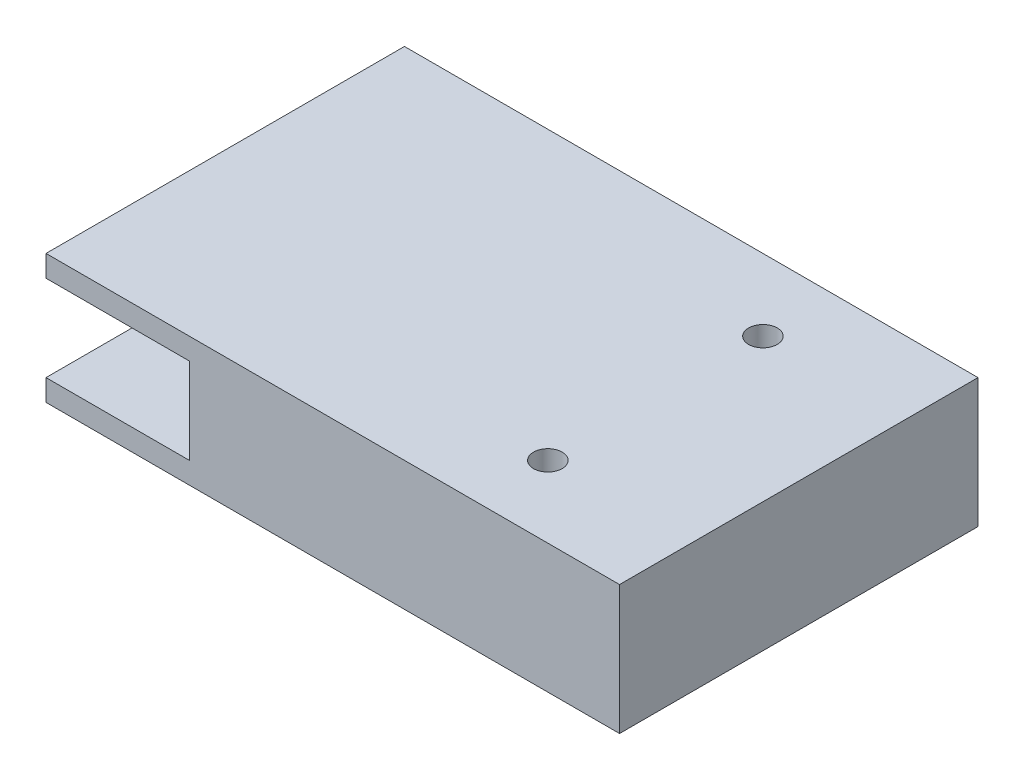
ISO-10303-21;
HEADER;
FILE_DESCRIPTION(('STEP AP214'),'2;1');
FILE_NAME('part.step','',(''),(''),'','','');
FILE_SCHEMA(('AUTOMOTIVE_DESIGN { 1 0 10303 214 1 1 1 1 }'));
ENDSEC;
DATA;
#1=APPLICATION_CONTEXT('core data for automotive mechanical design processes');
#2=APPLICATION_PROTOCOL_DEFINITION('international standard','automotive_design',2000,#1);
#3=PRODUCT_CONTEXT('',#1,'mechanical');
#4=PRODUCT('Part','Part','',(#3));
#5=PRODUCT_RELATED_PRODUCT_CATEGORY('part','',(#4));
#6=PRODUCT_DEFINITION_FORMATION('','',#4);
#7=PRODUCT_DEFINITION_CONTEXT('part definition',#1,'design');
#8=PRODUCT_DEFINITION('design','',#6,#7);
#9=PRODUCT_DEFINITION_SHAPE('','',#8);
#10=(LENGTH_UNIT() NAMED_UNIT(*) SI_UNIT(.MILLI.,.METRE.));
#11=(NAMED_UNIT(*) PLANE_ANGLE_UNIT() SI_UNIT($,.RADIAN.));
#12=(NAMED_UNIT(*) SI_UNIT($,.STERADIAN.) SOLID_ANGLE_UNIT());
#13=UNCERTAINTY_MEASURE_WITH_UNIT(LENGTH_MEASURE(1.E-05),#10,'distance_accuracy_value','');
#14=(GEOMETRIC_REPRESENTATION_CONTEXT(3) GLOBAL_UNCERTAINTY_ASSIGNED_CONTEXT((#13)) GLOBAL_UNIT_ASSIGNED_CONTEXT((#10,
#11,#12)) REPRESENTATION_CONTEXT('',''));
#15=CARTESIAN_POINT('',(0.,0.,0.));
#16=DIRECTION('',(0.,0.,1.));
#17=DIRECTION('',(1.,0.,0.));
#18=AXIS2_PLACEMENT_3D('',#15,#16,#17);
#19=CARTESIAN_POINT('',(-40.,3.,-25.));
#20=DIRECTION('',(0.,0.,1.));
#21=DIRECTION('',(1.,0.,0.));
#22=AXIS2_PLACEMENT_3D('',#19,#20,#21);
#23=PLANE('',#22);
#24=DIRECTION('',(0.866025403784439,0.5,0.));
#25=VECTOR('',#24,1.);
#26=CARTESIAN_POINT('',(-17.,10.1547005383793,-25.));
#27=LINE('',#26,#25);
#28=CARTESIAN_POINT('',(-17.,10.1547005383793,-25.));
#29=VERTEX_POINT('',#28);
#30=CARTESIAN_POINT('',(-15.,11.3094010767585,-25.));
#31=VERTEX_POINT('',#30);
#32=EDGE_CURVE('E198',#29,#31,#27,.T.);
#33=ORIENTED_EDGE('',*,*,#32,.F.);
#34=DIRECTION('',(0.,1.,0.));
#35=VECTOR('',#34,1.);
#36=CARTESIAN_POINT('',(-17.,7.84529946162075,-25.));
#37=LINE('',#36,#35);
#38=CARTESIAN_POINT('',(-17.,7.84529946162075,-25.));
#39=VERTEX_POINT('',#38);
#40=EDGE_CURVE('E211',#39,#29,#37,.T.);
#41=ORIENTED_EDGE('',*,*,#40,.F.);
#42=DIRECTION('',(-0.866025403784439,0.5,0.));
#43=VECTOR('',#42,1.);
#44=CARTESIAN_POINT('',(-15.,6.6905989232415,-25.));
#45=LINE('',#44,#43);
#46=CARTESIAN_POINT('',(-15.,6.69059892324149,-25.));
#47=VERTEX_POINT('',#46);
#48=EDGE_CURVE('E230',#47,#39,#45,.T.);
#49=ORIENTED_EDGE('',*,*,#48,.F.);
#50=DIRECTION('',(-0.866025403784439,-0.5,0.));
#51=VECTOR('',#50,1.);
#52=CARTESIAN_POINT('',(-13.,7.84529946162075,-25.));
#53=LINE('',#52,#51);
#54=CARTESIAN_POINT('',(-13.,7.84529946162075,-25.));
#55=VERTEX_POINT('',#54);
#56=EDGE_CURVE('E227',#55,#47,#53,.T.);
#57=ORIENTED_EDGE('',*,*,#56,.F.);
#58=DIRECTION('',(0.,-1.,0.));
#59=VECTOR('',#58,1.);
#60=CARTESIAN_POINT('',(-13.,10.1547005383793,-25.));
#61=LINE('',#60,#59);
#62=CARTESIAN_POINT('',(-13.,10.1547005383793,-25.));
#63=VERTEX_POINT('',#62);
#64=EDGE_CURVE('E224',#63,#55,#61,.T.);
#65=ORIENTED_EDGE('',*,*,#64,.F.);
#66=DIRECTION('',(0.866025403784438,-0.5,0.));
#67=VECTOR('',#66,1.);
#68=CARTESIAN_POINT('',(-15.,11.3094010767585,-25.));
#69=LINE('',#68,#67);
#70=EDGE_CURVE('E201',#31,#63,#69,.T.);
#71=ORIENTED_EDGE('',*,*,#70,.F.);
#72=EDGE_LOOP('',(#33,#41,#49,#57,#65,#71));
#73=FACE_BOUND('',#72,.T.);
#74=DIRECTION('',(-1.,0.,0.));
#75=VECTOR('',#74,1.);
#76=CARTESIAN_POINT('',(-40.,0.,-25.));
#77=LINE('',#76,#75);
#78=CARTESIAN_POINT('',(40.,0.,-25.));
#79=VERTEX_POINT('',#78);
#80=CARTESIAN_POINT('',(-40.,0.,-25.));
#81=VERTEX_POINT('',#80);
#82=EDGE_CURVE('E319',#79,#81,#77,.T.);
#83=ORIENTED_EDGE('',*,*,#82,.T.);
#84=DIRECTION('',(0.,-1.,0.));
#85=VECTOR('',#84,1.);
#86=CARTESIAN_POINT('',(-40.,3.,-25.));
#87=LINE('',#86,#85);
#88=CARTESIAN_POINT('',(-40.,3.,-25.));
#89=VERTEX_POINT('',#88);
#90=EDGE_CURVE('E329',#89,#81,#87,.T.);
#91=ORIENTED_EDGE('',*,*,#90,.F.);
#92=DIRECTION('',(-1.,0.,0.));
#93=VECTOR('',#92,1.);
#94=CARTESIAN_POINT('',(-40.,3.,-25.));
#95=LINE('',#94,#93);
#96=CARTESIAN_POINT('',(-20.,3.,-25.));
#97=VERTEX_POINT('',#96);
#98=EDGE_CURVE('E309',#97,#89,#95,.T.);
#99=ORIENTED_EDGE('',*,*,#98,.F.);
#100=DIRECTION('',(0.,-1.,0.));
#101=VECTOR('',#100,1.);
#102=CARTESIAN_POINT('',(-20.,15.,-25.));
#103=LINE('',#102,#101);
#104=CARTESIAN_POINT('',(-20.,15.,-25.));
#105=VERTEX_POINT('',#104);
#106=EDGE_CURVE('E305',#105,#97,#103,.T.);
#107=ORIENTED_EDGE('',*,*,#106,.F.);
#108=DIRECTION('',(-1.,0.,0.));
#109=VECTOR('',#108,1.);
#110=CARTESIAN_POINT('',(40.,15.,-25.));
#111=LINE('',#110,#109);
#112=CARTESIAN_POINT('',(-40.,15.,-25.));
#113=VERTEX_POINT('',#112);
#114=EDGE_CURVE('E264',#105,#113,#111,.T.);
#115=ORIENTED_EDGE('',*,*,#114,.T.);
#116=DIRECTION('',(0.,-1.,0.));
#117=VECTOR('',#116,1.);
#118=CARTESIAN_POINT('',(-40.,18.,-25.));
#119=LINE('',#118,#117);
#120=CARTESIAN_POINT('',(-40.,18.,-25.));
#121=VERTEX_POINT('',#120);
#122=EDGE_CURVE('E284',#121,#113,#119,.T.);
#123=ORIENTED_EDGE('',*,*,#122,.F.);
#124=DIRECTION('',(-1.,0.,0.));
#125=VECTOR('',#124,1.);
#126=CARTESIAN_POINT('',(40.,18.,-25.));
#127=LINE('',#126,#125);
#128=CARTESIAN_POINT('',(40.,18.,-25.));
#129=VERTEX_POINT('',#128);
#130=EDGE_CURVE('E268',#129,#121,#127,.T.);
#131=ORIENTED_EDGE('',*,*,#130,.F.);
#132=DIRECTION('',(0.,-1.,0.));
#133=VECTOR('',#132,1.);
#134=CARTESIAN_POINT('',(40.,3.,-25.));
#135=LINE('',#134,#133);
#136=EDGE_CURVE('E332',#129,#79,#135,.T.);
#137=ORIENTED_EDGE('',*,*,#136,.T.);
#138=EDGE_LOOP('',(#83,#91,#99,#107,#115,#123,#131,#137));
#139=FACE_BOUND('',#138,.T.);
#140=DIRECTION('',(0.866025403784439,0.5,0.));
#141=VECTOR('',#140,1.);
#142=CARTESIAN_POINT('',(-6.99999999999999,10.1547005383793,-25.));
#143=LINE('',#142,#141);
#144=CARTESIAN_POINT('',(-6.99999999999999,10.1547005383793,-25.));
#145=VERTEX_POINT('',#144);
#146=CARTESIAN_POINT('',(-5.,11.3094010767585,-25.));
#147=VERTEX_POINT('',#146);
#148=EDGE_CURVE('E197',#145,#147,#143,.T.);
#149=ORIENTED_EDGE('',*,*,#148,.F.);
#150=DIRECTION('',(0.,1.,0.));
#151=VECTOR('',#150,1.);
#152=CARTESIAN_POINT('',(-6.99999999999999,7.84529946162075,-25.));
#153=LINE('',#152,#151);
#154=CARTESIAN_POINT('',(-6.99999999999999,7.84529946162075,-25.));
#155=VERTEX_POINT('',#154);
#156=EDGE_CURVE('E194',#155,#145,#153,.T.);
#157=ORIENTED_EDGE('',*,*,#156,.F.);
#158=DIRECTION('',(-0.866025403784438,0.5,0.));
#159=VECTOR('',#158,1.);
#160=CARTESIAN_POINT('',(-4.99999999999999,6.6905989232415,-25.));
#161=LINE('',#160,#159);
#162=CARTESIAN_POINT('',(-4.99999999999999,6.6905989232415,-25.));
#163=VERTEX_POINT('',#162);
#164=EDGE_CURVE('E361',#163,#155,#161,.T.);
#165=ORIENTED_EDGE('',*,*,#164,.F.);
#166=DIRECTION('',(-0.866025403784439,-0.5,0.));
#167=VECTOR('',#166,1.);
#168=CARTESIAN_POINT('',(-2.99999999999999,7.84529946162075,-25.));
#169=LINE('',#168,#167);
#170=CARTESIAN_POINT('',(-2.99999999999999,7.84529946162074,-25.));
#171=VERTEX_POINT('',#170);
#172=EDGE_CURVE('E358',#171,#163,#169,.T.);
#173=ORIENTED_EDGE('',*,*,#172,.F.);
#174=DIRECTION('',(0.,-1.,0.));
#175=VECTOR('',#174,1.);
#176=CARTESIAN_POINT('',(-2.99999999999999,10.1547005383793,-25.));
#177=LINE('',#176,#175);
#178=CARTESIAN_POINT('',(-2.99999999999999,10.1547005383793,-25.));
#179=VERTEX_POINT('',#178);
#180=EDGE_CURVE('E60',#179,#171,#177,.T.);
#181=ORIENTED_EDGE('',*,*,#180,.F.);
#182=DIRECTION('',(0.866025403784439,-0.5,0.));
#183=VECTOR('',#182,1.);
#184=CARTESIAN_POINT('',(-4.99999999999999,11.3094010767585,-25.));
#185=LINE('',#184,#183);
#186=EDGE_CURVE('E55',#147,#179,#185,.T.);
#187=ORIENTED_EDGE('',*,*,#186,.F.);
#188=EDGE_LOOP('',(#149,#157,#165,#173,#181,#187));
#189=FACE_BOUND('',#188,.T.);
#190=ADVANCED_FACE('F38',(#73,#139,#189),#23,.F.);
#191=CARTESIAN_POINT('',(0.,3.,0.));
#192=DIRECTION('',(0.,-1.,0.));
#193=DIRECTION('',(0.,0.,-1.));
#194=AXIS2_PLACEMENT_3D('',#191,#192,#193);
#195=PLANE('',#194);
#196=CARTESIAN_POINT('',(-30.,3.,-11.));
#197=DIRECTION('',(0.,-1.,0.));
#198=DIRECTION('',(0.,0.,-1.));
#199=AXIS2_PLACEMENT_3D('',#196,#197,#198);
#200=CIRCLE('',#199,2.);
#201=CARTESIAN_POINT('',(-30.,3.,-13.));
#202=VERTEX_POINT('',#201);
#203=EDGE_CURVE('E335',#202,#202,#200,.F.);
#204=ORIENTED_EDGE('',*,*,#203,.F.);
#205=EDGE_LOOP('',(#204));
#206=FACE_BOUND('',#205,.T.);
#207=CARTESIAN_POINT('',(-30.,3.,11.));
#208=DIRECTION('',(0.,-1.,0.));
#209=DIRECTION('',(0.,0.,-1.));
#210=AXIS2_PLACEMENT_3D('',#207,#208,#209);
#211=CIRCLE('',#210,2.);
#212=CARTESIAN_POINT('',(-30.,3.,9.));
#213=VERTEX_POINT('',#212);
#214=EDGE_CURVE('E337',#213,#213,#211,.F.);
#215=ORIENTED_EDGE('',*,*,#214,.F.);
#216=EDGE_LOOP('',(#215));
#217=FACE_BOUND('',#216,.T.);
#218=DIRECTION('',(0.,0.,1.));
#219=VECTOR('',#218,1.);
#220=CARTESIAN_POINT('',(-20.,3.,-25.));
#221=LINE('',#220,#219);
#222=CARTESIAN_POINT('',(-20.,3.,25.));
#223=VERTEX_POINT('',#222);
#224=EDGE_CURVE('E294',#97,#223,#221,.T.);
#225=ORIENTED_EDGE('',*,*,#224,.F.);
#226=ORIENTED_EDGE('',*,*,#98,.T.);
#227=DIRECTION('',(0.,0.,1.));
#228=VECTOR('',#227,1.);
#229=CARTESIAN_POINT('',(-40.,3.,25.));
#230=LINE('',#229,#228);
#231=CARTESIAN_POINT('',(-40.,3.,25.));
#232=VERTEX_POINT('',#231);
#233=EDGE_CURVE('E311',#89,#232,#230,.T.);
#234=ORIENTED_EDGE('',*,*,#233,.T.);
#235=DIRECTION('',(1.,0.,0.));
#236=VECTOR('',#235,1.);
#237=CARTESIAN_POINT('',(-40.,3.,25.));
#238=LINE('',#237,#236);
#239=EDGE_CURVE('E314',#232,#223,#238,.T.);
#240=ORIENTED_EDGE('',*,*,#239,.T.);
#241=EDGE_LOOP('',(#225,#226,#234,#240));
#242=FACE_BOUND('',#241,.T.);
#243=ADVANCED_FACE('F387',(#206,#217,#242),#195,.F.);
#244=CARTESIAN_POINT('',(40.,3.,25.));
#245=DIRECTION('',(-1.,0.,0.));
#246=DIRECTION('',(0.,0.,1.));
#247=AXIS2_PLACEMENT_3D('',#244,#245,#246);
#248=PLANE('',#247);
#249=DIRECTION('',(0.,0.,-1.));
#250=VECTOR('',#249,1.);
#251=CARTESIAN_POINT('',(40.,0.,25.));
#252=LINE('',#251,#250);
#253=CARTESIAN_POINT('',(40.,0.,25.));
#254=VERTEX_POINT('',#253);
#255=EDGE_CURVE('E308',#254,#79,#252,.T.);
#256=ORIENTED_EDGE('',*,*,#255,.T.);
#257=ORIENTED_EDGE('',*,*,#136,.F.);
#258=DIRECTION('',(0.,0.,-1.));
#259=VECTOR('',#258,1.);
#260=CARTESIAN_POINT('',(40.,18.,-25.));
#261=LINE('',#260,#259);
#262=CARTESIAN_POINT('',(40.,18.,25.));
#263=VERTEX_POINT('',#262);
#264=EDGE_CURVE('E265',#263,#129,#261,.T.);
#265=ORIENTED_EDGE('',*,*,#264,.F.);
#266=DIRECTION('',(0.,-1.,0.));
#267=VECTOR('',#266,1.);
#268=CARTESIAN_POINT('',(40.,3.,25.));
#269=LINE('',#268,#267);
#270=EDGE_CURVE('E316',#263,#254,#269,.T.);
#271=ORIENTED_EDGE('',*,*,#270,.T.);
#272=EDGE_LOOP('',(#256,#257,#265,#271));
#273=FACE_BOUND('',#272,.T.);
#274=ADVANCED_FACE('F40',(#273),#248,.F.);
#275=CARTESIAN_POINT('',(-40.,3.,25.));
#276=DIRECTION('',(1.,0.,0.));
#277=DIRECTION('',(0.,0.,-1.));
#278=AXIS2_PLACEMENT_3D('',#275,#276,#277);
#279=PLANE('',#278);
#280=DIRECTION('',(0.,0.,1.));
#281=VECTOR('',#280,1.);
#282=CARTESIAN_POINT('',(-40.,0.,25.));
#283=LINE('',#282,#281);
#284=CARTESIAN_POINT('',(-40.,0.,25.));
#285=VERTEX_POINT('',#284);
#286=EDGE_CURVE('E321',#81,#285,#283,.T.);
#287=ORIENTED_EDGE('',*,*,#286,.T.);
#288=DIRECTION('',(0.,-1.,0.));
#289=VECTOR('',#288,1.);
#290=CARTESIAN_POINT('',(-40.,3.,25.));
#291=LINE('',#290,#289);
#292=EDGE_CURVE('E326',#232,#285,#291,.T.);
#293=ORIENTED_EDGE('',*,*,#292,.F.);
#294=ORIENTED_EDGE('',*,*,#233,.F.);
#295=ORIENTED_EDGE('',*,*,#90,.T.);
#296=EDGE_LOOP('',(#287,#293,#294,#295));
#297=FACE_BOUND('',#296,.T.);
#298=ADVANCED_FACE('F396',(#297),#279,.F.);
#299=CARTESIAN_POINT('',(-40.,3.,25.));
#300=DIRECTION('',(0.,0.,-1.));
#301=DIRECTION('',(-1.,0.,0.));
#302=AXIS2_PLACEMENT_3D('',#299,#300,#301);
#303=PLANE('',#302);
#304=DIRECTION('',(1.,0.,0.));
#305=VECTOR('',#304,1.);
#306=CARTESIAN_POINT('',(-40.,0.,25.));
#307=LINE('',#306,#305);
#308=EDGE_CURVE('E312',#285,#254,#307,.T.);
#309=ORIENTED_EDGE('',*,*,#308,.T.);
#310=ORIENTED_EDGE('',*,*,#270,.F.);
#311=DIRECTION('',(1.,0.,0.));
#312=VECTOR('',#311,1.);
#313=CARTESIAN_POINT('',(40.,18.,25.));
#314=LINE('',#313,#312);
#315=CARTESIAN_POINT('',(-40.,18.,25.));
#316=VERTEX_POINT('',#315);
#317=EDGE_CURVE('E273',#316,#263,#314,.T.);
#318=ORIENTED_EDGE('',*,*,#317,.F.);
#319=DIRECTION('',(0.,-1.,0.));
#320=VECTOR('',#319,1.);
#321=CARTESIAN_POINT('',(-40.,18.,25.));
#322=LINE('',#321,#320);
#323=CARTESIAN_POINT('',(-40.,15.,25.));
#324=VERTEX_POINT('',#323);
#325=EDGE_CURVE('E276',#316,#324,#322,.T.);
#326=ORIENTED_EDGE('',*,*,#325,.T.);
#327=DIRECTION('',(1.,0.,0.));
#328=VECTOR('',#327,1.);
#329=CARTESIAN_POINT('',(40.,15.,25.));
#330=LINE('',#329,#328);
#331=CARTESIAN_POINT('',(-20.,15.,25.));
#332=VERTEX_POINT('',#331);
#333=EDGE_CURVE('E269',#324,#332,#330,.T.);
#334=ORIENTED_EDGE('',*,*,#333,.T.);
#335=DIRECTION('',(0.,-1.,0.));
#336=VECTOR('',#335,1.);
#337=CARTESIAN_POINT('',(-20.,15.,25.));
#338=LINE('',#337,#336);
#339=EDGE_CURVE('E300',#332,#223,#338,.T.);
#340=ORIENTED_EDGE('',*,*,#339,.T.);
#341=ORIENTED_EDGE('',*,*,#239,.F.);
#342=ORIENTED_EDGE('',*,*,#292,.T.);
#343=EDGE_LOOP('',(#309,#310,#318,#326,#334,#340,#341,#342));
#344=FACE_BOUND('',#343,.T.);
#345=ADVANCED_FACE('F399',(#344),#303,.F.);
#346=CARTESIAN_POINT('',(0.,0.,0.));
#347=DIRECTION('',(0.,-1.,0.));
#348=DIRECTION('',(0.,0.,-1.));
#349=AXIS2_PLACEMENT_3D('',#346,#347,#348);
#350=PLANE('',#349);
#351=CARTESIAN_POINT('',(20.,0.,15.));
#352=DIRECTION('',(0.,-1.,0.));
#353=DIRECTION('',(0.,0.,-1.));
#354=AXIS2_PLACEMENT_3D('',#351,#352,#353);
#355=CIRCLE('',#354,2.);
#356=CARTESIAN_POINT('',(20.,0.,13.));
#357=VERTEX_POINT('',#356);
#358=EDGE_CURVE('E261',#357,#357,#355,.T.);
#359=ORIENTED_EDGE('',*,*,#358,.F.);
#360=EDGE_LOOP('',(#359));
#361=FACE_BOUND('',#360,.T.);
#362=CARTESIAN_POINT('',(20.,0.,-15.));
#363=DIRECTION('',(0.,-1.,0.));
#364=DIRECTION('',(0.,0.,-1.));
#365=AXIS2_PLACEMENT_3D('',#362,#363,#364);
#366=CIRCLE('',#365,2.);
#367=CARTESIAN_POINT('',(20.,0.,-17.));
#368=VERTEX_POINT('',#367);
#369=EDGE_CURVE('E256',#368,#368,#366,.T.);
#370=ORIENTED_EDGE('',*,*,#369,.F.);
#371=EDGE_LOOP('',(#370));
#372=FACE_BOUND('',#371,.T.);
#373=ORIENTED_EDGE('',*,*,#255,.F.);
#374=ORIENTED_EDGE('',*,*,#308,.F.);
#375=ORIENTED_EDGE('',*,*,#286,.F.);
#376=ORIENTED_EDGE('',*,*,#82,.F.);
#377=EDGE_LOOP('',(#373,#374,#375,#376));
#378=FACE_BOUND('',#377,.T.);
#379=ADVANCED_FACE('F403',(#361,#372,#378),#350,.T.);
#380=CARTESIAN_POINT('',(-30.,17.,-11.));
#381=DIRECTION('',(0.,-1.,0.));
#382=DIRECTION('',(0.,0.,-1.));
#383=AXIS2_PLACEMENT_3D('',#380,#381,#382);
#384=CYLINDRICAL_SURFACE('',#383,2.);
#385=CARTESIAN_POINT('',(-30.,15.,-11.));
#386=DIRECTION('',(0.,-1.,0.));
#387=DIRECTION('',(0.,0.,-1.));
#388=AXIS2_PLACEMENT_3D('',#385,#386,#387);
#389=CIRCLE('',#388,2.);
#390=CARTESIAN_POINT('',(-30.,15.,-13.));
#391=VERTEX_POINT('',#390);
#392=EDGE_CURVE('E287',#391,#391,#389,.T.);
#393=ORIENTED_EDGE('',*,*,#392,.T.);
#394=EDGE_LOOP('',(#393));
#395=FACE_BOUND('',#394,.T.);
#396=ORIENTED_EDGE('',*,*,#203,.T.);
#397=EDGE_LOOP('',(#396));
#398=FACE_BOUND('',#397,.T.);
#399=ADVANCED_FACE('F406',(#395,#398),#384,.T.);
#400=CARTESIAN_POINT('',(-30.,17.,11.));
#401=DIRECTION('',(0.,-1.,0.));
#402=DIRECTION('',(0.,0.,-1.));
#403=AXIS2_PLACEMENT_3D('',#400,#401,#402);
#404=CYLINDRICAL_SURFACE('',#403,2.);
#405=CARTESIAN_POINT('',(-30.,15.,11.));
#406=DIRECTION('',(0.,-1.,0.));
#407=DIRECTION('',(0.,0.,-1.));
#408=AXIS2_PLACEMENT_3D('',#405,#406,#407);
#409=CIRCLE('',#408,2.);
#410=CARTESIAN_POINT('',(-30.,15.,9.));
#411=VERTEX_POINT('',#410);
#412=EDGE_CURVE('E42',#411,#411,#409,.T.);
#413=ORIENTED_EDGE('',*,*,#412,.T.);
#414=EDGE_LOOP('',(#413));
#415=FACE_BOUND('',#414,.T.);
#416=ORIENTED_EDGE('',*,*,#214,.T.);
#417=EDGE_LOOP('',(#416));
#418=FACE_BOUND('',#417,.T.);
#419=ADVANCED_FACE('F411',(#415,#418),#404,.T.);
#420=CARTESIAN_POINT('',(-20.,15.,-25.));
#421=DIRECTION('',(1.,0.,0.));
#422=DIRECTION('',(0.,0.,-1.));
#423=AXIS2_PLACEMENT_3D('',#420,#421,#422);
#424=PLANE('',#423);
#425=CARTESIAN_POINT('',(-20.,11.,0.));
#426=DIRECTION('',(-1.,0.,0.));
#427=DIRECTION('',(0.,0.,1.));
#428=AXIS2_PLACEMENT_3D('',#425,#426,#427);
#429=CIRCLE('',#428,3.);
#430=CARTESIAN_POINT('',(-20.,11.,3.));
#431=VERTEX_POINT('',#430);
#432=EDGE_CURVE('E290',#431,#431,#429,.T.);
#433=ORIENTED_EDGE('',*,*,#432,.F.);
#434=EDGE_LOOP('',(#433));
#435=FACE_BOUND('',#434,.T.);
#436=ORIENTED_EDGE('',*,*,#224,.T.);
#437=ORIENTED_EDGE('',*,*,#339,.F.);
#438=DIRECTION('',(0.,0.,1.));
#439=VECTOR('',#438,1.);
#440=CARTESIAN_POINT('',(-20.,15.,-25.));
#441=LINE('',#440,#439);
#442=EDGE_CURVE('E297',#105,#332,#441,.T.);
#443=ORIENTED_EDGE('',*,*,#442,.F.);
#444=ORIENTED_EDGE('',*,*,#106,.T.);
#445=EDGE_LOOP('',(#436,#437,#443,#444));
#446=FACE_BOUND('',#445,.T.);
#447=ADVANCED_FACE('F415',(#435,#446),#424,.F.);
#448=CARTESIAN_POINT('',(-9.99999999999999,11.,0.));
#449=DIRECTION('',(-1.,0.,0.));
#450=DIRECTION('',(0.,0.,1.));
#451=AXIS2_PLACEMENT_3D('',#448,#449,#450);
#452=CYLINDRICAL_SURFACE('',#451,3.);
#453=CARTESIAN_POINT('',(-9.99999999999999,11.,0.));
#454=DIRECTION('',(-1.,0.,0.));
#455=DIRECTION('',(0.,0.,1.));
#456=AXIS2_PLACEMENT_3D('',#453,#454,#455);
#457=CIRCLE('',#456,3.);
#458=CARTESIAN_POINT('',(-9.99999999999999,11.,3.));
#459=VERTEX_POINT('',#458);
#460=EDGE_CURVE('E291',#459,#459,#457,.T.);
#461=ORIENTED_EDGE('',*,*,#460,.F.);
#462=EDGE_LOOP('',(#461));
#463=FACE_BOUND('',#462,.T.);
#464=ORIENTED_EDGE('',*,*,#432,.T.);
#465=EDGE_LOOP('',(#464));
#466=FACE_BOUND('',#465,.T.);
#467=ADVANCED_FACE('F419',(#463,#466),#452,.F.);
#468=CARTESIAN_POINT('',(-9.99999999999999,11.,0.));
#469=DIRECTION('',(-1.,0.,0.));
#470=DIRECTION('',(0.,0.,1.));
#471=AXIS2_PLACEMENT_3D('',#468,#469,#470);
#472=PLANE('',#471);
#473=ORIENTED_EDGE('',*,*,#460,.T.);
#474=EDGE_LOOP('',(#473));
#475=FACE_BOUND('',#474,.T.);
#476=ADVANCED_FACE('F423',(#475),#472,.T.);
#477=CARTESIAN_POINT('',(0.,15.,0.));
#478=DIRECTION('',(0.,-1.,0.));
#479=DIRECTION('',(0.,0.,-1.));
#480=AXIS2_PLACEMENT_3D('',#477,#478,#479);
#481=PLANE('',#480);
#482=ORIENTED_EDGE('',*,*,#392,.F.);
#483=EDGE_LOOP('',(#482));
#484=FACE_BOUND('',#483,.T.);
#485=ORIENTED_EDGE('',*,*,#412,.F.);
#486=EDGE_LOOP('',(#485));
#487=FACE_BOUND('',#486,.T.);
#488=ORIENTED_EDGE('',*,*,#114,.F.);
#489=ORIENTED_EDGE('',*,*,#442,.T.);
#490=ORIENTED_EDGE('',*,*,#333,.F.);
#491=DIRECTION('',(0.,0.,1.));
#492=VECTOR('',#491,1.);
#493=CARTESIAN_POINT('',(-40.,15.,-25.));
#494=LINE('',#493,#492);
#495=EDGE_CURVE('E278',#113,#324,#494,.T.);
#496=ORIENTED_EDGE('',*,*,#495,.F.);
#497=EDGE_LOOP('',(#488,#489,#490,#496));
#498=FACE_BOUND('',#497,.T.);
#499=ADVANCED_FACE('F427',(#484,#487,#498),#481,.T.);
#500=CARTESIAN_POINT('',(-40.,18.,-25.));
#501=DIRECTION('',(1.,0.,0.));
#502=DIRECTION('',(0.,0.,-1.));
#503=AXIS2_PLACEMENT_3D('',#500,#501,#502);
#504=PLANE('',#503);
#505=ORIENTED_EDGE('',*,*,#495,.T.);
#506=ORIENTED_EDGE('',*,*,#325,.F.);
#507=DIRECTION('',(0.,0.,1.));
#508=VECTOR('',#507,1.);
#509=CARTESIAN_POINT('',(-40.,18.,-25.));
#510=LINE('',#509,#508);
#511=EDGE_CURVE('E271',#121,#316,#510,.T.);
#512=ORIENTED_EDGE('',*,*,#511,.F.);
#513=ORIENTED_EDGE('',*,*,#122,.T.);
#514=EDGE_LOOP('',(#505,#506,#512,#513));
#515=FACE_BOUND('',#514,.T.);
#516=ADVANCED_FACE('F429',(#515),#504,.F.);
#517=CARTESIAN_POINT('',(0.,18.,0.));
#518=DIRECTION('',(0.,-1.,0.));
#519=DIRECTION('',(0.,0.,-1.));
#520=AXIS2_PLACEMENT_3D('',#517,#518,#519);
#521=PLANE('',#520);
#522=CARTESIAN_POINT('',(20.,18.,15.));
#523=DIRECTION('',(0.,1.,0.));
#524=DIRECTION('',(0.,0.,1.));
#525=AXIS2_PLACEMENT_3D('',#522,#523,#524);
#526=CIRCLE('',#525,2.);
#527=CARTESIAN_POINT('',(20.,18.,17.));
#528=VERTEX_POINT('',#527);
#529=EDGE_CURVE('E253',#528,#528,#526,.T.);
#530=ORIENTED_EDGE('',*,*,#529,.F.);
#531=EDGE_LOOP('',(#530));
#532=FACE_BOUND('',#531,.T.);
#533=CARTESIAN_POINT('',(20.,18.,-15.));
#534=DIRECTION('',(0.,1.,0.));
#535=DIRECTION('',(0.,0.,1.));
#536=AXIS2_PLACEMENT_3D('',#533,#534,#535);
#537=CIRCLE('',#536,2.);
#538=CARTESIAN_POINT('',(20.,18.,-13.));
#539=VERTEX_POINT('',#538);
#540=EDGE_CURVE('E252',#539,#539,#537,.T.);
#541=ORIENTED_EDGE('',*,*,#540,.F.);
#542=EDGE_LOOP('',(#541));
#543=FACE_BOUND('',#542,.T.);
#544=ORIENTED_EDGE('',*,*,#264,.T.);
#545=ORIENTED_EDGE('',*,*,#130,.T.);
#546=ORIENTED_EDGE('',*,*,#511,.T.);
#547=ORIENTED_EDGE('',*,*,#317,.T.);
#548=EDGE_LOOP('',(#544,#545,#546,#547));
#549=FACE_BOUND('',#548,.T.);
#550=ADVANCED_FACE('F432',(#532,#543,#549),#521,.F.);
#551=CARTESIAN_POINT('',(20.,-31.,-15.));
#552=DIRECTION('',(0.,1.,0.));
#553=DIRECTION('',(0.,0.,1.));
#554=AXIS2_PLACEMENT_3D('',#551,#552,#553);
#555=CYLINDRICAL_SURFACE('',#554,2.);
#556=ORIENTED_EDGE('',*,*,#369,.T.);
#557=EDGE_LOOP('',(#556));
#558=FACE_BOUND('',#557,.T.);
#559=ORIENTED_EDGE('',*,*,#540,.T.);
#560=EDGE_LOOP('',(#559));
#561=FACE_BOUND('',#560,.T.);
#562=ADVANCED_FACE('F439',(#558,#561),#555,.F.);
#563=CARTESIAN_POINT('',(20.,-31.,15.));
#564=DIRECTION('',(0.,1.,0.));
#565=DIRECTION('',(0.,0.,1.));
#566=AXIS2_PLACEMENT_3D('',#563,#564,#565);
#567=CYLINDRICAL_SURFACE('',#566,2.);
#568=ORIENTED_EDGE('',*,*,#358,.T.);
#569=EDGE_LOOP('',(#568));
#570=FACE_BOUND('',#569,.T.);
#571=ORIENTED_EDGE('',*,*,#529,.T.);
#572=EDGE_LOOP('',(#571));
#573=FACE_BOUND('',#572,.T.);
#574=ADVANCED_FACE('F443',(#570,#573),#567,.F.);
#575=CARTESIAN_POINT('',(-17.,10.1547005383793,-28.));
#576=DIRECTION('',(0.5,-0.866025403784439,0.));
#577=DIRECTION('',(0.866025403784439,0.5,0.));
#578=AXIS2_PLACEMENT_3D('',#575,#576,#577);
#579=PLANE('',#578);
#580=ORIENTED_EDGE('',*,*,#32,.T.);
#581=DIRECTION('',(0.,0.,1.));
#582=VECTOR('',#581,1.);
#583=CARTESIAN_POINT('',(-15.,11.3094010767585,-28.));
#584=LINE('',#583,#582);
#585=CARTESIAN_POINT('',(-15.,11.3094010767585,-28.));
#586=VERTEX_POINT('',#585);
#587=EDGE_CURVE('E249',#586,#31,#584,.T.);
#588=ORIENTED_EDGE('',*,*,#587,.F.);
#589=DIRECTION('',(0.866025403784439,0.5,0.));
#590=VECTOR('',#589,1.);
#591=CARTESIAN_POINT('',(-17.,10.1547005383793,-28.));
#592=LINE('',#591,#590);
#593=CARTESIAN_POINT('',(-17.,10.1547005383793,-28.));
#594=VERTEX_POINT('',#593);
#595=EDGE_CURVE('E207',#594,#586,#592,.T.);
#596=ORIENTED_EDGE('',*,*,#595,.F.);
#597=DIRECTION('',(0.,0.,1.));
#598=VECTOR('',#597,1.);
#599=CARTESIAN_POINT('',(-17.,10.1547005383793,-28.));
#600=LINE('',#599,#598);
#601=EDGE_CURVE('E220',#594,#29,#600,.T.);
#602=ORIENTED_EDGE('',*,*,#601,.T.);
#603=EDGE_LOOP('',(#580,#588,#596,#602));
#604=FACE_BOUND('',#603,.T.);
#605=ADVANCED_FACE('F447',(#604),#579,.F.);
#606=CARTESIAN_POINT('',(-15.,11.3094010767585,-28.));
#607=DIRECTION('',(-0.5,-0.866025403784439,0.));
#608=DIRECTION('',(0.866025403784439,-0.5,0.));
#609=AXIS2_PLACEMENT_3D('',#606,#607,#608);
#610=PLANE('',#609);
#611=ORIENTED_EDGE('',*,*,#70,.T.);
#612=DIRECTION('',(0.,0.,1.));
#613=VECTOR('',#612,1.);
#614=CARTESIAN_POINT('',(-13.,10.1547005383793,-28.));
#615=LINE('',#614,#613);
#616=CARTESIAN_POINT('',(-13.,10.1547005383793,-28.));
#617=VERTEX_POINT('',#616);
#618=EDGE_CURVE('E246',#617,#63,#615,.T.);
#619=ORIENTED_EDGE('',*,*,#618,.F.);
#620=DIRECTION('',(0.866025403784438,-0.5,0.));
#621=VECTOR('',#620,1.);
#622=CARTESIAN_POINT('',(-15.,11.3094010767585,-28.));
#623=LINE('',#622,#621);
#624=EDGE_CURVE('E210',#586,#617,#623,.T.);
#625=ORIENTED_EDGE('',*,*,#624,.F.);
#626=ORIENTED_EDGE('',*,*,#587,.T.);
#627=EDGE_LOOP('',(#611,#619,#625,#626));
#628=FACE_BOUND('',#627,.T.);
#629=ADVANCED_FACE('F451',(#628),#610,.F.);
#630=CARTESIAN_POINT('',(-13.,10.1547005383793,-28.));
#631=DIRECTION('',(-1.,0.,0.));
#632=DIRECTION('',(0.,0.,1.));
#633=AXIS2_PLACEMENT_3D('',#630,#631,#632);
#634=PLANE('',#633);
#635=ORIENTED_EDGE('',*,*,#64,.T.);
#636=DIRECTION('',(0.,0.,1.));
#637=VECTOR('',#636,1.);
#638=CARTESIAN_POINT('',(-13.,7.84529946162075,-28.));
#639=LINE('',#638,#637);
#640=CARTESIAN_POINT('',(-13.,7.84529946162075,-28.));
#641=VERTEX_POINT('',#640);
#642=EDGE_CURVE('E243',#641,#55,#639,.T.);
#643=ORIENTED_EDGE('',*,*,#642,.F.);
#644=DIRECTION('',(0.,-1.,0.));
#645=VECTOR('',#644,1.);
#646=CARTESIAN_POINT('',(-13.,10.1547005383793,-28.));
#647=LINE('',#646,#645);
#648=EDGE_CURVE('E213',#617,#641,#647,.T.);
#649=ORIENTED_EDGE('',*,*,#648,.F.);
#650=ORIENTED_EDGE('',*,*,#618,.T.);
#651=EDGE_LOOP('',(#635,#643,#649,#650));
#652=FACE_BOUND('',#651,.T.);
#653=ADVANCED_FACE('F455',(#652),#634,.F.);
#654=CARTESIAN_POINT('',(-13.,7.84529946162075,-28.));
#655=DIRECTION('',(-0.5,0.866025403784439,0.));
#656=DIRECTION('',(-0.866025403784439,-0.5,0.));
#657=AXIS2_PLACEMENT_3D('',#654,#655,#656);
#658=PLANE('',#657);
#659=ORIENTED_EDGE('',*,*,#56,.T.);
#660=DIRECTION('',(0.,0.,1.));
#661=VECTOR('',#660,1.);
#662=CARTESIAN_POINT('',(-15.,6.6905989232415,-28.));
#663=LINE('',#662,#661);
#664=CARTESIAN_POINT('',(-15.,6.6905989232415,-28.));
#665=VERTEX_POINT('',#664);
#666=EDGE_CURVE('E240',#665,#47,#663,.T.);
#667=ORIENTED_EDGE('',*,*,#666,.F.);
#668=DIRECTION('',(-0.866025403784439,-0.5,0.));
#669=VECTOR('',#668,1.);
#670=CARTESIAN_POINT('',(-13.,7.84529946162075,-28.));
#671=LINE('',#670,#669);
#672=EDGE_CURVE('E215',#641,#665,#671,.T.);
#673=ORIENTED_EDGE('',*,*,#672,.F.);
#674=ORIENTED_EDGE('',*,*,#642,.T.);
#675=EDGE_LOOP('',(#659,#667,#673,#674));
#676=FACE_BOUND('',#675,.T.);
#677=ADVANCED_FACE('F459',(#676),#658,.F.);
#678=CARTESIAN_POINT('',(-15.,6.6905989232415,-28.));
#679=DIRECTION('',(0.5,0.866025403784439,0.));
#680=DIRECTION('',(-0.866025403784439,0.5,0.));
#681=AXIS2_PLACEMENT_3D('',#678,#679,#680);
#682=PLANE('',#681);
#683=ORIENTED_EDGE('',*,*,#48,.T.);
#684=DIRECTION('',(0.,0.,1.));
#685=VECTOR('',#684,1.);
#686=CARTESIAN_POINT('',(-17.,7.84529946162075,-28.));
#687=LINE('',#686,#685);
#688=CARTESIAN_POINT('',(-17.,7.84529946162075,-28.));
#689=VERTEX_POINT('',#688);
#690=EDGE_CURVE('E237',#689,#39,#687,.T.);
#691=ORIENTED_EDGE('',*,*,#690,.F.);
#692=DIRECTION('',(-0.866025403784439,0.5,0.));
#693=VECTOR('',#692,1.);
#694=CARTESIAN_POINT('',(-15.,6.6905989232415,-28.));
#695=LINE('',#694,#693);
#696=EDGE_CURVE('E217',#665,#689,#695,.T.);
#697=ORIENTED_EDGE('',*,*,#696,.F.);
#698=ORIENTED_EDGE('',*,*,#666,.T.);
#699=EDGE_LOOP('',(#683,#691,#697,#698));
#700=FACE_BOUND('',#699,.T.);
#701=ADVANCED_FACE('F463',(#700),#682,.F.);
#702=CARTESIAN_POINT('',(-17.,7.84529946162075,-28.));
#703=DIRECTION('',(1.,0.,0.));
#704=DIRECTION('',(0.,0.,-1.));
#705=AXIS2_PLACEMENT_3D('',#702,#703,#704);
#706=PLANE('',#705);
#707=ORIENTED_EDGE('',*,*,#40,.T.);
#708=ORIENTED_EDGE('',*,*,#601,.F.);
#709=DIRECTION('',(0.,1.,0.));
#710=VECTOR('',#709,1.);
#711=CARTESIAN_POINT('',(-17.,7.84529946162075,-28.));
#712=LINE('',#711,#710);
#713=EDGE_CURVE('E219',#689,#594,#712,.T.);
#714=ORIENTED_EDGE('',*,*,#713,.F.);
#715=ORIENTED_EDGE('',*,*,#690,.T.);
#716=EDGE_LOOP('',(#707,#708,#714,#715));
#717=FACE_BOUND('',#716,.T.);
#718=ADVANCED_FACE('F467',(#717),#706,.F.);
#719=CARTESIAN_POINT('',(0.,0.,-28.));
#720=DIRECTION('',(0.,0.,-1.));
#721=DIRECTION('',(-1.,0.,0.));
#722=AXIS2_PLACEMENT_3D('',#719,#720,#721);
#723=PLANE('',#722);
#724=CARTESIAN_POINT('',(-14.8839130092036,9.00000000000001,-28.));
#725=DIRECTION('',(0.,0.,-1.));
#726=DIRECTION('',(-1.,0.,0.));
#727=AXIS2_PLACEMENT_3D('',#724,#725,#726);
#728=CIRCLE('',#727,1.);
#729=CARTESIAN_POINT('',(-15.8839130092036,9.00000000000001,-28.));
#730=VERTEX_POINT('',#729);
#731=EDGE_CURVE('E47',#730,#730,#728,.T.);
#732=ORIENTED_EDGE('',*,*,#731,.F.);
#733=EDGE_LOOP('',(#732));
#734=FACE_BOUND('',#733,.T.);
#735=ORIENTED_EDGE('',*,*,#595,.T.);
#736=ORIENTED_EDGE('',*,*,#624,.T.);
#737=ORIENTED_EDGE('',*,*,#648,.T.);
#738=ORIENTED_EDGE('',*,*,#672,.T.);
#739=ORIENTED_EDGE('',*,*,#696,.T.);
#740=ORIENTED_EDGE('',*,*,#713,.T.);
#741=EDGE_LOOP('',(#735,#736,#737,#738,#739,#740));
#742=FACE_BOUND('',#741,.T.);
#743=ADVANCED_FACE('F471',(#734,#742),#723,.T.);
#744=CARTESIAN_POINT('',(-6.99999999999999,10.1547005383793,-28.));
#745=DIRECTION('',(0.5,-0.866025403784439,0.));
#746=DIRECTION('',(0.866025403784439,0.5,0.));
#747=AXIS2_PLACEMENT_3D('',#744,#745,#746);
#748=PLANE('',#747);
#749=ORIENTED_EDGE('',*,*,#148,.T.);
#750=DIRECTION('',(0.,0.,1.));
#751=VECTOR('',#750,1.);
#752=CARTESIAN_POINT('',(-4.99999999999999,11.3094010767585,-28.));
#753=LINE('',#752,#751);
#754=CARTESIAN_POINT('',(-4.99999999999999,11.3094010767585,-28.));
#755=VERTEX_POINT('',#754);
#756=EDGE_CURVE('E178',#755,#147,#753,.T.);
#757=ORIENTED_EDGE('',*,*,#756,.F.);
#758=DIRECTION('',(0.866025403784439,0.5,0.));
#759=VECTOR('',#758,1.);
#760=CARTESIAN_POINT('',(-6.99999999999999,10.1547005383793,-28.));
#761=LINE('',#760,#759);
#762=CARTESIAN_POINT('',(-6.99999999999999,10.1547005383793,-28.));
#763=VERTEX_POINT('',#762);
#764=EDGE_CURVE('E185',#763,#755,#761,.T.);
#765=ORIENTED_EDGE('',*,*,#764,.F.);
#766=DIRECTION('',(0.,0.,1.));
#767=VECTOR('',#766,1.);
#768=CARTESIAN_POINT('',(-6.99999999999999,10.1547005383793,-28.));
#769=LINE('',#768,#767);
#770=EDGE_CURVE('E354',#763,#145,#769,.T.);
#771=ORIENTED_EDGE('',*,*,#770,.T.);
#772=EDGE_LOOP('',(#749,#757,#765,#771));
#773=FACE_BOUND('',#772,.T.);
#774=ADVANCED_FACE('F196',(#773),#748,.F.);
#775=CARTESIAN_POINT('',(-4.99999999999999,11.3094010767585,-28.));
#776=DIRECTION('',(-0.5,-0.866025403784439,0.));
#777=DIRECTION('',(0.866025403784439,-0.5,0.));
#778=AXIS2_PLACEMENT_3D('',#775,#776,#777);
#779=PLANE('',#778);
#780=ORIENTED_EDGE('',*,*,#186,.T.);
#781=DIRECTION('',(0.,0.,1.));
#782=VECTOR('',#781,1.);
#783=CARTESIAN_POINT('',(-2.99999999999999,10.1547005383793,-28.));
#784=LINE('',#783,#782);
#785=CARTESIAN_POINT('',(-2.99999999999999,10.1547005383793,-28.));
#786=VERTEX_POINT('',#785);
#787=EDGE_CURVE('E181',#786,#179,#784,.T.);
#788=ORIENTED_EDGE('',*,*,#787,.F.);
#789=DIRECTION('',(0.866025403784439,-0.5,0.));
#790=VECTOR('',#789,1.);
#791=CARTESIAN_POINT('',(-4.99999999999999,11.3094010767585,-28.));
#792=LINE('',#791,#790);
#793=EDGE_CURVE('E174',#755,#786,#792,.T.);
#794=ORIENTED_EDGE('',*,*,#793,.F.);
#795=ORIENTED_EDGE('',*,*,#756,.T.);
#796=EDGE_LOOP('',(#780,#788,#794,#795));
#797=FACE_BOUND('',#796,.T.);
#798=ADVANCED_FACE('F176',(#797),#779,.F.);
#799=CARTESIAN_POINT('',(-2.99999999999999,10.1547005383793,-28.));
#800=DIRECTION('',(-1.,0.,0.));
#801=DIRECTION('',(0.,0.,1.));
#802=AXIS2_PLACEMENT_3D('',#799,#800,#801);
#803=PLANE('',#802);
#804=ORIENTED_EDGE('',*,*,#180,.T.);
#805=DIRECTION('',(0.,0.,1.));
#806=VECTOR('',#805,1.);
#807=CARTESIAN_POINT('',(-2.99999999999999,7.84529946162075,-28.));
#808=LINE('',#807,#806);
#809=CARTESIAN_POINT('',(-2.99999999999999,7.84529946162075,-28.));
#810=VERTEX_POINT('',#809);
#811=EDGE_CURVE('E203',#810,#171,#808,.T.);
#812=ORIENTED_EDGE('',*,*,#811,.F.);
#813=DIRECTION('',(0.,-1.,0.));
#814=VECTOR('',#813,1.);
#815=CARTESIAN_POINT('',(-2.99999999999999,10.1547005383793,-28.));
#816=LINE('',#815,#814);
#817=EDGE_CURVE('E184',#786,#810,#816,.T.);
#818=ORIENTED_EDGE('',*,*,#817,.F.);
#819=ORIENTED_EDGE('',*,*,#787,.T.);
#820=EDGE_LOOP('',(#804,#812,#818,#819));
#821=FACE_BOUND('',#820,.T.);
#822=ADVANCED_FACE('F379',(#821),#803,.F.);
#823=CARTESIAN_POINT('',(-2.99999999999999,7.84529946162075,-28.));
#824=DIRECTION('',(-0.5,0.866025403784439,0.));
#825=DIRECTION('',(-0.866025403784439,-0.5,0.));
#826=AXIS2_PLACEMENT_3D('',#823,#824,#825);
#827=PLANE('',#826);
#828=ORIENTED_EDGE('',*,*,#172,.T.);
#829=DIRECTION('',(0.,0.,1.));
#830=VECTOR('',#829,1.);
#831=CARTESIAN_POINT('',(-4.99999999999999,6.6905989232415,-28.));
#832=LINE('',#831,#830);
#833=CARTESIAN_POINT('',(-4.99999999999999,6.6905989232415,-28.));
#834=VERTEX_POINT('',#833);
#835=EDGE_CURVE('E370',#834,#163,#832,.T.);
#836=ORIENTED_EDGE('',*,*,#835,.F.);
#837=DIRECTION('',(-0.866025403784439,-0.5,0.));
#838=VECTOR('',#837,1.);
#839=CARTESIAN_POINT('',(-2.99999999999999,7.84529946162075,-28.));
#840=LINE('',#839,#838);
#841=EDGE_CURVE('E349',#810,#834,#840,.T.);
#842=ORIENTED_EDGE('',*,*,#841,.F.);
#843=ORIENTED_EDGE('',*,*,#811,.T.);
#844=EDGE_LOOP('',(#828,#836,#842,#843));
#845=FACE_BOUND('',#844,.T.);
#846=ADVANCED_FACE('F376',(#845),#827,.F.);
#847=CARTESIAN_POINT('',(-4.99999999999999,6.6905989232415,-28.));
#848=DIRECTION('',(0.500000000000001,0.866025403784438,0.));
#849=DIRECTION('',(-0.866025403784438,0.500000000000001,0.));
#850=AXIS2_PLACEMENT_3D('',#847,#848,#849);
#851=PLANE('',#850);
#852=ORIENTED_EDGE('',*,*,#164,.T.);
#853=DIRECTION('',(0.,0.,1.));
#854=VECTOR('',#853,1.);
#855=CARTESIAN_POINT('',(-6.99999999999999,7.84529946162075,-28.));
#856=LINE('',#855,#854);
#857=CARTESIAN_POINT('',(-6.99999999999999,7.84529946162075,-28.));
#858=VERTEX_POINT('',#857);
#859=EDGE_CURVE('E367',#858,#155,#856,.T.);
#860=ORIENTED_EDGE('',*,*,#859,.F.);
#861=DIRECTION('',(-0.866025403784438,0.5,0.));
#862=VECTOR('',#861,1.);
#863=CARTESIAN_POINT('',(-4.99999999999999,6.6905989232415,-28.));
#864=LINE('',#863,#862);
#865=EDGE_CURVE('E351',#834,#858,#864,.T.);
#866=ORIENTED_EDGE('',*,*,#865,.F.);
#867=ORIENTED_EDGE('',*,*,#835,.T.);
#868=EDGE_LOOP('',(#852,#860,#866,#867));
#869=FACE_BOUND('',#868,.T.);
#870=ADVANCED_FACE('F383',(#869),#851,.F.);
#871=CARTESIAN_POINT('',(-6.99999999999999,7.84529946162075,-28.));
#872=DIRECTION('',(1.,0.,0.));
#873=DIRECTION('',(0.,1.,0.));
#874=AXIS2_PLACEMENT_3D('',#871,#872,#873);
#875=PLANE('',#874);
#876=ORIENTED_EDGE('',*,*,#156,.T.);
#877=ORIENTED_EDGE('',*,*,#770,.F.);
#878=DIRECTION('',(0.,1.,0.));
#879=VECTOR('',#878,1.);
#880=CARTESIAN_POINT('',(-6.99999999999999,7.84529946162075,-28.));
#881=LINE('',#880,#879);
#882=EDGE_CURVE('E190',#858,#763,#881,.T.);
#883=ORIENTED_EDGE('',*,*,#882,.F.);
#884=ORIENTED_EDGE('',*,*,#859,.T.);
#885=EDGE_LOOP('',(#876,#877,#883,#884));
#886=FACE_BOUND('',#885,.T.);
#887=ADVANCED_FACE('F385',(#886),#875,.F.);
#888=CARTESIAN_POINT('',(0.,0.,-28.));
#889=DIRECTION('',(0.,0.,-1.));
#890=DIRECTION('',(-1.,0.,0.));
#891=AXIS2_PLACEMENT_3D('',#888,#889,#890);
#892=PLANE('',#891);
#893=CARTESIAN_POINT('',(-4.99999999999999,9.00000000000001,-28.));
#894=DIRECTION('',(0.,0.,-1.));
#895=DIRECTION('',(-1.,0.,0.));
#896=AXIS2_PLACEMENT_3D('',#893,#894,#895);
#897=CIRCLE('',#896,1.);
#898=CARTESIAN_POINT('',(-5.99999999999999,9.00000000000001,-28.));
#899=VERTEX_POINT('',#898);
#900=EDGE_CURVE('E11',#899,#899,#897,.T.);
#901=ORIENTED_EDGE('',*,*,#900,.F.);
#902=EDGE_LOOP('',(#901));
#903=FACE_BOUND('',#902,.T.);
#904=ORIENTED_EDGE('',*,*,#764,.T.);
#905=ORIENTED_EDGE('',*,*,#793,.T.);
#906=ORIENTED_EDGE('',*,*,#817,.T.);
#907=ORIENTED_EDGE('',*,*,#841,.T.);
#908=ORIENTED_EDGE('',*,*,#865,.T.);
#909=ORIENTED_EDGE('',*,*,#882,.T.);
#910=EDGE_LOOP('',(#904,#905,#906,#907,#908,#909));
#911=FACE_BOUND('',#910,.T.);
#912=ADVANCED_FACE('F188',(#903,#911),#892,.T.);
#913=CARTESIAN_POINT('',(-14.8839130092036,9.00000000000001,-30.));
#914=DIRECTION('',(0.,0.,1.));
#915=DIRECTION('',(1.,0.,0.));
#916=AXIS2_PLACEMENT_3D('',#913,#914,#915);
#917=CYLINDRICAL_SURFACE('',#916,1.);
#918=CARTESIAN_POINT('',(-14.8839130092036,9.00000000000001,-30.));
#919=DIRECTION('',(0.,0.,-1.));
#920=DIRECTION('',(-1.,0.,0.));
#921=AXIS2_PLACEMENT_3D('',#918,#919,#920);
#922=CIRCLE('',#921,1.);
#923=CARTESIAN_POINT('',(-15.8839130092036,9.00000000000001,-30.));
#924=VERTEX_POINT('',#923);
#925=EDGE_CURVE('E346',#924,#924,#922,.T.);
#926=ORIENTED_EDGE('',*,*,#925,.F.);
#927=EDGE_LOOP('',(#926));
#928=FACE_BOUND('',#927,.T.);
#929=ORIENTED_EDGE('',*,*,#731,.T.);
#930=EDGE_LOOP('',(#929));
#931=FACE_BOUND('',#930,.T.);
#932=ADVANCED_FACE('F490',(#928,#931),#917,.T.);
#933=CARTESIAN_POINT('',(-14.8839130092036,9.00000000000001,-30.));
#934=DIRECTION('',(0.,0.,-1.));
#935=DIRECTION('',(-1.,0.,0.));
#936=AXIS2_PLACEMENT_3D('',#933,#934,#935);
#937=PLANE('',#936);
#938=ORIENTED_EDGE('',*,*,#925,.T.);
#939=EDGE_LOOP('',(#938));
#940=FACE_BOUND('',#939,.T.);
#941=ADVANCED_FACE('F494',(#940),#937,.T.);
#942=CARTESIAN_POINT('',(-4.99999999999999,9.00000000000001,-30.));
#943=DIRECTION('',(0.,0.,1.));
#944=DIRECTION('',(1.,0.,0.));
#945=AXIS2_PLACEMENT_3D('',#942,#943,#944);
#946=CYLINDRICAL_SURFACE('',#945,1.);
#947=CARTESIAN_POINT('',(-4.99999999999999,9.00000000000001,-30.));
#948=DIRECTION('',(0.,0.,-1.));
#949=DIRECTION('',(-1.,0.,0.));
#950=AXIS2_PLACEMENT_3D('',#947,#948,#949);
#951=CIRCLE('',#950,1.);
#952=CARTESIAN_POINT('',(-5.99999999999999,9.00000000000001,-30.));
#953=VERTEX_POINT('',#952);
#954=EDGE_CURVE('E510',#953,#953,#951,.T.);
#955=ORIENTED_EDGE('',*,*,#954,.F.);
#956=EDGE_LOOP('',(#955));
#957=FACE_BOUND('',#956,.T.);
#958=ORIENTED_EDGE('',*,*,#900,.T.);
#959=EDGE_LOOP('',(#958));
#960=FACE_BOUND('',#959,.T.);
#961=ADVANCED_FACE('F498',(#957,#960),#946,.T.);
#962=CARTESIAN_POINT('',(-4.99999999999999,9.00000000000001,-30.));
#963=DIRECTION('',(0.,0.,-1.));
#964=DIRECTION('',(-1.,0.,0.));
#965=AXIS2_PLACEMENT_3D('',#962,#963,#964);
#966=PLANE('',#965);
#967=ORIENTED_EDGE('',*,*,#954,.T.);
#968=EDGE_LOOP('',(#967));
#969=FACE_BOUND('',#968,.T.);
#970=ADVANCED_FACE('F502',(#969),#966,.T.);
#971=CLOSED_SHELL('',(#190,#243,#274,#298,#345,#379,#399,#419,#447,#467,#476,#499,#516,#550,
#562,#574,#605,#629,#653,#677,#701,#718,#743,#774,#798,#822,#846,#870,#887,#912,#932,#941,#961,#970));
#972=MANIFOLD_SOLID_BREP('B2',#971);
#973=ADVANCED_BREP_SHAPE_REPRESENTATION('',(#18,#972),#14);
#974=SHAPE_DEFINITION_REPRESENTATION(#9,#973);
ENDSEC;
END-ISO-10303-21;
